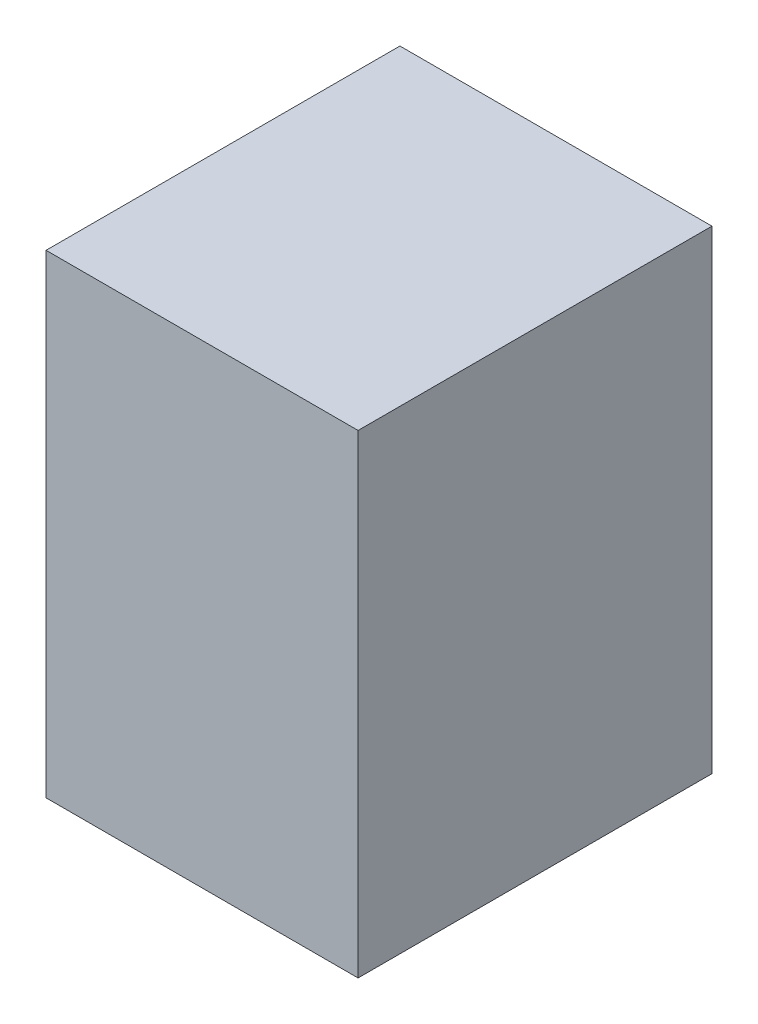
ISO-10303-21;
HEADER;
FILE_DESCRIPTION(('STEP AP214'),'2;1');
FILE_NAME('part.step','',(''),(''),'','','');
FILE_SCHEMA(('AUTOMOTIVE_DESIGN { 1 0 10303 214 1 1 1 1 }'));
ENDSEC;
DATA;
#1=APPLICATION_CONTEXT('core data for automotive mechanical design processes');
#2=APPLICATION_PROTOCOL_DEFINITION('international standard','automotive_design',2000,#1);
#3=PRODUCT_CONTEXT('',#1,'mechanical');
#4=PRODUCT('Part','Part','',(#3));
#5=PRODUCT_RELATED_PRODUCT_CATEGORY('part','',(#4));
#6=PRODUCT_DEFINITION_FORMATION('','',#4);
#7=PRODUCT_DEFINITION_CONTEXT('part definition',#1,'design');
#8=PRODUCT_DEFINITION('design','',#6,#7);
#9=PRODUCT_DEFINITION_SHAPE('','',#8);
#10=(LENGTH_UNIT() NAMED_UNIT(*) SI_UNIT(.MILLI.,.METRE.));
#11=(NAMED_UNIT(*) PLANE_ANGLE_UNIT() SI_UNIT($,.RADIAN.));
#12=(NAMED_UNIT(*) SI_UNIT($,.STERADIAN.) SOLID_ANGLE_UNIT());
#13=UNCERTAINTY_MEASURE_WITH_UNIT(LENGTH_MEASURE(1.E-05),#10,'distance_accuracy_value','');
#14=(GEOMETRIC_REPRESENTATION_CONTEXT(3) GLOBAL_UNCERTAINTY_ASSIGNED_CONTEXT((#13)) GLOBAL_UNIT_ASSIGNED_CONTEXT((#10,
#11,#12)) REPRESENTATION_CONTEXT('',''));
#15=CARTESIAN_POINT('',(0.,0.,0.));
#16=DIRECTION('',(0.,0.,1.));
#17=DIRECTION('',(1.,0.,0.));
#18=AXIS2_PLACEMENT_3D('',#15,#16,#17);
#19=CARTESIAN_POINT('',(-3.60864989540742,-39.8632487144539,-16.3414214772802));
#20=DIRECTION('',(0.,0.,1.));
#21=DIRECTION('',(1.,0.,0.));
#22=AXIS2_PLACEMENT_3D('',#19,#20,#21);
#23=PLANE('',#22);
#24=CARTESIAN_POINT('',(-3.60864989540742,-37.8582195429255,-16.3414214772802));
#25=CARTESIAN_POINT('',(-3.60864989540742,-39.8632487144539,-16.3414214772802));
#26=(BOUNDED_CURVE() B_SPLINE_CURVE(1,(#24,#25),.UNSPECIFIED.,.F.,
.F.) B_SPLINE_CURVE_WITH_KNOTS((2,2),(0.,2.00502917152843),
.UNSPECIFIED.) CURVE() GEOMETRIC_REPRESENTATION_ITEM() RATIONAL_B_SPLINE_CURVE((1.,1.)) REPRESENTATION_ITEM(''));
#27=CARTESIAN_POINT('',(-3.60864989540742,-37.8582195429255,-16.3414214772802));
#28=VERTEX_POINT('',#27);
#29=CARTESIAN_POINT('',(-3.60864989540742,-39.8632487144539,-16.3414214772802));
#30=VERTEX_POINT('',#29);
#31=EDGE_CURVE('E29',#28,#30,#26,.T.);
#32=ORIENTED_EDGE('',*,*,#31,.F.);
#33=CARTESIAN_POINT('',(-4.9279028488027,-37.8582195429255,-16.3414214772802));
#34=CARTESIAN_POINT('',(-3.60864989540742,-37.8582195429255,-16.3414214772802));
#35=(BOUNDED_CURVE() B_SPLINE_CURVE(1,(#33,#34),.UNSPECIFIED.,.F.,
.F.) B_SPLINE_CURVE_WITH_KNOTS((2,2),(0.,1.31925295339528),
.UNSPECIFIED.) CURVE() GEOMETRIC_REPRESENTATION_ITEM() RATIONAL_B_SPLINE_CURVE((1.,1.)) REPRESENTATION_ITEM(''));
#36=CARTESIAN_POINT('',(-4.9279028488027,-37.8582195429255,-16.3414214772802));
#37=VERTEX_POINT('',#36);
#38=EDGE_CURVE('E20',#37,#28,#35,.T.);
#39=ORIENTED_EDGE('',*,*,#38,.F.);
#40=CARTESIAN_POINT('',(-4.9279028488027,-39.8632487144539,-16.3414214772802));
#41=CARTESIAN_POINT('',(-4.9279028488027,-37.8582195429255,-16.3414214772802));
#42=(BOUNDED_CURVE() B_SPLINE_CURVE(1,(#40,#41),.UNSPECIFIED.,.F.,
.F.) B_SPLINE_CURVE_WITH_KNOTS((2,2),(0.,2.00502917152843),
.UNSPECIFIED.) CURVE() GEOMETRIC_REPRESENTATION_ITEM() RATIONAL_B_SPLINE_CURVE((1.,1.)) REPRESENTATION_ITEM(''));
#43=CARTESIAN_POINT('',(-4.9279028488027,-39.8632487144539,-16.3414214772802));
#44=VERTEX_POINT('',#43);
#45=EDGE_CURVE('E69',#44,#37,#42,.T.);
#46=ORIENTED_EDGE('',*,*,#45,.F.);
#47=CARTESIAN_POINT('',(-3.60864989540742,-39.8632487144539,-16.3414214772802));
#48=CARTESIAN_POINT('',(-4.9279028488027,-39.8632487144539,-16.3414214772802));
#49=(BOUNDED_CURVE() B_SPLINE_CURVE(1,(#47,#48),.UNSPECIFIED.,.F.,
.F.) B_SPLINE_CURVE_WITH_KNOTS((2,2),(0.,1.31925295339528),
.UNSPECIFIED.) CURVE() GEOMETRIC_REPRESENTATION_ITEM() RATIONAL_B_SPLINE_CURVE((1.,1.)) REPRESENTATION_ITEM(''));
#50=EDGE_CURVE('E72',#30,#44,#49,.T.);
#51=ORIENTED_EDGE('',*,*,#50,.F.);
#52=EDGE_LOOP('',(#32,#39,#46,#51));
#53=FACE_BOUND('',#52,.T.);
#54=ADVANCED_FACE('F16',(#53),#23,.T.);
#55=CARTESIAN_POINT('',(-3.60864989540742,-39.8632487144539,-17.8375474982837));
#56=DIRECTION('',(0.,0.,-1.));
#57=DIRECTION('',(0.,-1.,0.));
#58=AXIS2_PLACEMENT_3D('',#55,#56,#57);
#59=PLANE('',#58);
#60=CARTESIAN_POINT('',(-3.60864989540742,-39.8632487144539,-17.8375474982837));
#61=CARTESIAN_POINT('',(-4.9279028488027,-39.8632487144539,-17.8375474982837));
#62=(BOUNDED_CURVE() B_SPLINE_CURVE(1,(#60,#61),.UNSPECIFIED.,.F.,
.F.) B_SPLINE_CURVE_WITH_KNOTS((2,2),(0.,1.31925295339528),
.UNSPECIFIED.) CURVE() GEOMETRIC_REPRESENTATION_ITEM() RATIONAL_B_SPLINE_CURVE((1.,1.)) REPRESENTATION_ITEM(''));
#63=CARTESIAN_POINT('',(-3.60864989540742,-39.8632487144539,-17.8375474982837));
#64=VERTEX_POINT('',#63);
#65=CARTESIAN_POINT('',(-4.9279028488027,-39.8632487144539,-17.8375474982837));
#66=VERTEX_POINT('',#65);
#67=EDGE_CURVE('E80',#64,#66,#62,.T.);
#68=ORIENTED_EDGE('',*,*,#67,.T.);
#69=CARTESIAN_POINT('',(-4.9279028488027,-39.8632487144539,-17.8375474982837));
#70=CARTESIAN_POINT('',(-4.9279028488027,-37.8582195429255,-17.8375474982837));
#71=(BOUNDED_CURVE() B_SPLINE_CURVE(1,(#69,#70),.UNSPECIFIED.,.F.,
.F.) B_SPLINE_CURVE_WITH_KNOTS((2,2),(0.,2.00502917152843),
.UNSPECIFIED.) CURVE() GEOMETRIC_REPRESENTATION_ITEM() RATIONAL_B_SPLINE_CURVE((1.,1.)) REPRESENTATION_ITEM(''));
#72=CARTESIAN_POINT('',(-4.9279028488027,-37.8582195429255,-17.8375474982837));
#73=VERTEX_POINT('',#72);
#74=EDGE_CURVE('E86',#66,#73,#71,.T.);
#75=ORIENTED_EDGE('',*,*,#74,.T.);
#76=CARTESIAN_POINT('',(-4.9279028488027,-37.8582195429255,-17.8375474982837));
#77=CARTESIAN_POINT('',(-3.60864989540742,-37.8582195429255,-17.8375474982837));
#78=(BOUNDED_CURVE() B_SPLINE_CURVE(1,(#76,#77),.UNSPECIFIED.,.F.,
.F.) B_SPLINE_CURVE_WITH_KNOTS((2,2),(0.,1.31925295339528),
.UNSPECIFIED.) CURVE() GEOMETRIC_REPRESENTATION_ITEM() RATIONAL_B_SPLINE_CURVE((1.,1.)) REPRESENTATION_ITEM(''));
#79=CARTESIAN_POINT('',(-3.60864989540742,-37.8582195429255,-17.8375474982837));
#80=VERTEX_POINT('',#79);
#81=EDGE_CURVE('E133',#73,#80,#78,.T.);
#82=ORIENTED_EDGE('',*,*,#81,.T.);
#83=CARTESIAN_POINT('',(-3.60864989540742,-37.8582195429255,-17.8375474982837));
#84=CARTESIAN_POINT('',(-3.60864989540742,-39.8632487144539,-17.8375474982837));
#85=(BOUNDED_CURVE() B_SPLINE_CURVE(1,(#83,#84),.UNSPECIFIED.,.F.,
.F.) B_SPLINE_CURVE_WITH_KNOTS((2,2),(0.,2.00502917152843),
.UNSPECIFIED.) CURVE() GEOMETRIC_REPRESENTATION_ITEM() RATIONAL_B_SPLINE_CURVE((1.,1.)) REPRESENTATION_ITEM(''));
#86=EDGE_CURVE('E11',#80,#64,#85,.T.);
#87=ORIENTED_EDGE('',*,*,#86,.T.);
#88=EDGE_LOOP('',(#68,#75,#82,#87));
#89=FACE_BOUND('',#88,.T.);
#90=ADVANCED_FACE('F168',(#89),#59,.T.);
#91=CARTESIAN_POINT('',(-3.60864989540742,-37.8582195429255,-17.8375474982837));
#92=DIRECTION('',(1.,0.,0.));
#93=DIRECTION('',(0.,1.,0.));
#94=AXIS2_PLACEMENT_3D('',#91,#92,#93);
#95=PLANE('',#94);
#96=CARTESIAN_POINT('',(-3.60864989540742,-37.8582195429255,-17.8375474982837));
#97=CARTESIAN_POINT('',(-3.60864989540742,-37.8582195429255,-16.3414214772802));
#98=(BOUNDED_CURVE() B_SPLINE_CURVE(1,(#96,#97),.UNSPECIFIED.,.F.,
.F.) B_SPLINE_CURVE_WITH_KNOTS((2,2),(0.,1.49612602100347),
.UNSPECIFIED.) CURVE() GEOMETRIC_REPRESENTATION_ITEM() RATIONAL_B_SPLINE_CURVE((1.,1.)) REPRESENTATION_ITEM(''));
#99=EDGE_CURVE('E125',#80,#28,#98,.T.);
#100=ORIENTED_EDGE('',*,*,#99,.T.);
#101=ORIENTED_EDGE('',*,*,#31,.T.);
#102=CARTESIAN_POINT('',(-3.60864989540742,-39.8632487144539,-17.8375474982837));
#103=CARTESIAN_POINT('',(-3.60864989540742,-39.8632487144539,-16.3414214772802));
#104=(BOUNDED_CURVE() B_SPLINE_CURVE(1,(#102,#103),.UNSPECIFIED.,.F.,
.F.) B_SPLINE_CURVE_WITH_KNOTS((2,2),(0.,1.49612602100347),
.UNSPECIFIED.) CURVE() GEOMETRIC_REPRESENTATION_ITEM() RATIONAL_B_SPLINE_CURVE((1.,1.)) REPRESENTATION_ITEM(''));
#105=EDGE_CURVE('E93',#64,#30,#104,.T.);
#106=ORIENTED_EDGE('',*,*,#105,.F.);
#107=ORIENTED_EDGE('',*,*,#86,.F.);
#108=EDGE_LOOP('',(#100,#101,#106,#107));
#109=FACE_BOUND('',#108,.T.);
#110=ADVANCED_FACE('F170',(#109),#95,.T.);
#111=CARTESIAN_POINT('',(-4.9279028488027,-37.8582195429255,-17.8375474982837));
#112=DIRECTION('',(0.,1.,0.));
#113=DIRECTION('',(1.,0.,0.));
#114=AXIS2_PLACEMENT_3D('',#111,#112,#113);
#115=PLANE('',#114);
#116=CARTESIAN_POINT('',(-4.9279028488027,-37.8582195429255,-17.8375474982837));
#117=CARTESIAN_POINT('',(-4.9279028488027,-37.8582195429255,-16.3414214772802));
#118=(BOUNDED_CURVE() B_SPLINE_CURVE(1,(#116,#117),.UNSPECIFIED.,.F.,
.F.) B_SPLINE_CURVE_WITH_KNOTS((2,2),(0.,1.49612602100347),
.UNSPECIFIED.) CURVE() GEOMETRIC_REPRESENTATION_ITEM() RATIONAL_B_SPLINE_CURVE((1.,1.)) REPRESENTATION_ITEM(''));
#119=EDGE_CURVE('E79',#73,#37,#118,.T.);
#120=ORIENTED_EDGE('',*,*,#119,.T.);
#121=ORIENTED_EDGE('',*,*,#38,.T.);
#122=ORIENTED_EDGE('',*,*,#99,.F.);
#123=ORIENTED_EDGE('',*,*,#81,.F.);
#124=EDGE_LOOP('',(#120,#121,#122,#123));
#125=FACE_BOUND('',#124,.T.);
#126=ADVANCED_FACE('F18',(#125),#115,.T.);
#127=CARTESIAN_POINT('',(-4.9279028488027,-39.8632487144539,-17.8375474982837));
#128=DIRECTION('',(-1.,0.,0.));
#129=DIRECTION('',(0.,0.,1.));
#130=AXIS2_PLACEMENT_3D('',#127,#128,#129);
#131=PLANE('',#130);
#132=CARTESIAN_POINT('',(-4.9279028488027,-39.8632487144539,-17.8375474982837));
#133=CARTESIAN_POINT('',(-4.9279028488027,-39.8632487144539,-16.3414214772802));
#134=(BOUNDED_CURVE() B_SPLINE_CURVE(1,(#132,#133),.UNSPECIFIED.,.F.,
.F.) B_SPLINE_CURVE_WITH_KNOTS((2,2),(0.,1.49612602100347),
.UNSPECIFIED.) CURVE() GEOMETRIC_REPRESENTATION_ITEM() RATIONAL_B_SPLINE_CURVE((1.,1.)) REPRESENTATION_ITEM(''));
#135=EDGE_CURVE('E83',#66,#44,#134,.T.);
#136=ORIENTED_EDGE('',*,*,#135,.T.);
#137=ORIENTED_EDGE('',*,*,#45,.T.);
#138=ORIENTED_EDGE('',*,*,#119,.F.);
#139=ORIENTED_EDGE('',*,*,#74,.F.);
#140=EDGE_LOOP('',(#136,#137,#138,#139));
#141=FACE_BOUND('',#140,.T.);
#142=ADVANCED_FACE('F84',(#141),#131,.T.);
#143=CARTESIAN_POINT('',(-3.60864989540742,-39.8632487144539,-17.8375474982837));
#144=DIRECTION('',(0.,-1.,0.));
#145=DIRECTION('',(0.,0.,-1.));
#146=AXIS2_PLACEMENT_3D('',#143,#144,#145);
#147=PLANE('',#146);
#148=ORIENTED_EDGE('',*,*,#105,.T.);
#149=ORIENTED_EDGE('',*,*,#50,.T.);
#150=ORIENTED_EDGE('',*,*,#135,.F.);
#151=ORIENTED_EDGE('',*,*,#67,.F.);
#152=EDGE_LOOP('',(#148,#149,#150,#151));
#153=FACE_BOUND('',#152,.T.);
#154=ADVANCED_FACE('F92',(#153),#147,.T.);
#155=CLOSED_SHELL('',(#54,#90,#110,#126,#142,#154));
#156=MANIFOLD_SOLID_BREP('B1',#155);
#157=ADVANCED_BREP_SHAPE_REPRESENTATION('',(#18,#156),#14);
#158=SHAPE_DEFINITION_REPRESENTATION(#9,#157);
ENDSEC;
END-ISO-10303-21;
